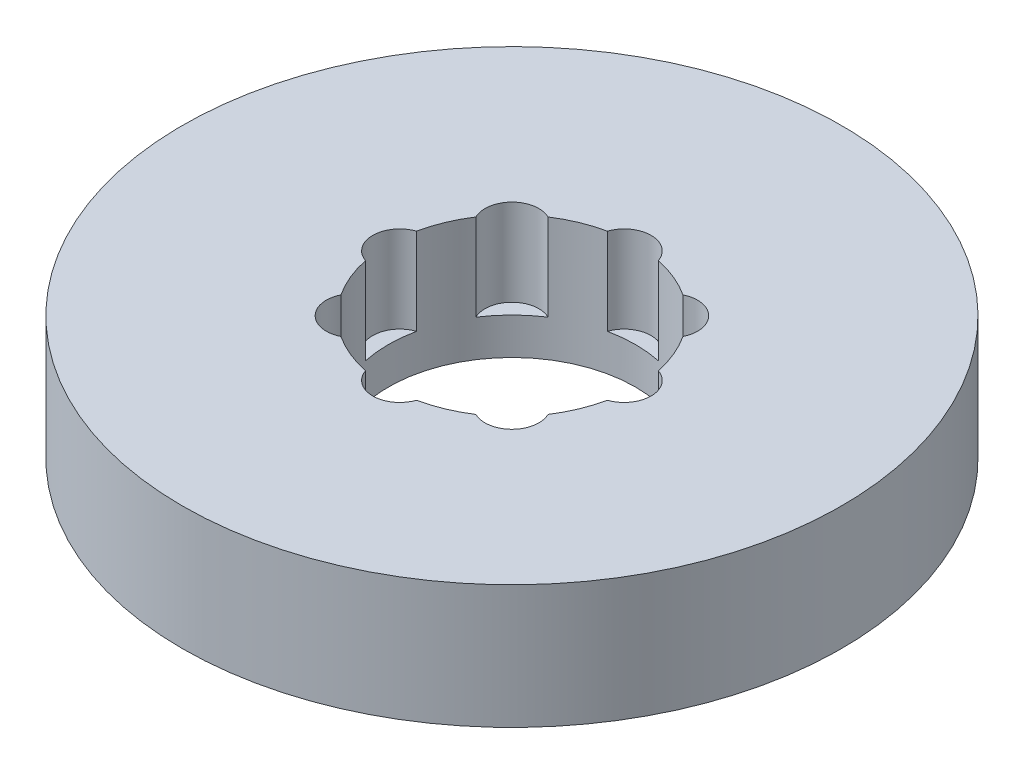
ISO-10303-21;
HEADER;
FILE_DESCRIPTION(('STEP AP214'),'2;1');
FILE_NAME('part.step','',(''),(''),'','','');
FILE_SCHEMA(('AUTOMOTIVE_DESIGN { 1 0 10303 214 1 1 1 1 }'));
ENDSEC;
DATA;
#1=APPLICATION_CONTEXT('core data for automotive mechanical design processes');
#2=APPLICATION_PROTOCOL_DEFINITION('international standard','automotive_design',2000,#1);
#3=PRODUCT_CONTEXT('',#1,'mechanical');
#4=PRODUCT('Part','Part','',(#3));
#5=PRODUCT_RELATED_PRODUCT_CATEGORY('part','',(#4));
#6=PRODUCT_DEFINITION_FORMATION('','',#4);
#7=PRODUCT_DEFINITION_CONTEXT('part definition',#1,'design');
#8=PRODUCT_DEFINITION('design','',#6,#7);
#9=PRODUCT_DEFINITION_SHAPE('','',#8);
#10=(LENGTH_UNIT() NAMED_UNIT(*) SI_UNIT(.MILLI.,.METRE.));
#11=(NAMED_UNIT(*) PLANE_ANGLE_UNIT() SI_UNIT($,.RADIAN.));
#12=(NAMED_UNIT(*) SI_UNIT($,.STERADIAN.) SOLID_ANGLE_UNIT());
#13=UNCERTAINTY_MEASURE_WITH_UNIT(LENGTH_MEASURE(1.E-05),#10,'distance_accuracy_value','');
#14=(GEOMETRIC_REPRESENTATION_CONTEXT(3) GLOBAL_UNCERTAINTY_ASSIGNED_CONTEXT((#13)) GLOBAL_UNIT_ASSIGNED_CONTEXT((#10,
#11,#12)) REPRESENTATION_CONTEXT('',''));
#15=CARTESIAN_POINT('',(0.,0.,0.));
#16=DIRECTION('',(0.,0.,1.));
#17=DIRECTION('',(1.,0.,0.));
#18=AXIS2_PLACEMENT_3D('',#15,#16,#17);
#19=CARTESIAN_POINT('',(0.,15.,0.));
#20=DIRECTION('',(0.,-1.,0.));
#21=DIRECTION('',(0.,0.,-1.));
#22=AXIS2_PLACEMENT_3D('',#19,#20,#21);
#23=CYLINDRICAL_SURFACE('',#22,40.);
#24=CARTESIAN_POINT('',(0.,15.,0.));
#25=DIRECTION('',(0.,1.,0.));
#26=DIRECTION('',(0.,0.,1.));
#27=AXIS2_PLACEMENT_3D('',#24,#25,#26);
#28=CIRCLE('',#27,40.);
#29=CARTESIAN_POINT('',(0.,15.,40.));
#30=VERTEX_POINT('',#29);
#31=EDGE_CURVE('E183',#30,#30,#28,.T.);
#32=ORIENTED_EDGE('',*,*,#31,.F.);
#33=EDGE_LOOP('',(#32));
#34=FACE_BOUND('',#33,.T.);
#35=CARTESIAN_POINT('',(0.,0.,0.));
#36=DIRECTION('',(0.,1.,0.));
#37=DIRECTION('',(0.,0.,1.));
#38=AXIS2_PLACEMENT_3D('',#35,#36,#37);
#39=CIRCLE('',#38,40.);
#40=CARTESIAN_POINT('',(0.,0.,40.));
#41=VERTEX_POINT('',#40);
#42=EDGE_CURVE('E182',#41,#41,#39,.T.);
#43=ORIENTED_EDGE('',*,*,#42,.T.);
#44=EDGE_LOOP('',(#43));
#45=FACE_BOUND('',#44,.T.);
#46=ADVANCED_FACE('F39',(#34,#45),#23,.T.);
#47=CARTESIAN_POINT('',(0.,15.,0.));
#48=DIRECTION('',(0.,1.,0.));
#49=DIRECTION('',(0.,0.,1.));
#50=AXIS2_PLACEMENT_3D('',#47,#48,#49);
#51=PLANE('',#50);
#52=CARTESIAN_POINT('',(0.,15.,13.6181477200669));
#53=DIRECTION('',(0.,1.,0.));
#54=DIRECTION('',(1.,0.,0.));
#55=AXIS2_PLACEMENT_3D('',#52,#53,#54);
#56=CIRCLE('',#55,3.27229028538122);
#57=CARTESIAN_POINT('',(-3.09625528298317,15.,14.6769616481954));
#58=VERTEX_POINT('',#57);
#59=CARTESIAN_POINT('',(3.09625528298327,15.,14.6769616481954));
#60=VERTEX_POINT('',#59);
#61=EDGE_CURVE('E256',#58,#60,#56,.T.);
#62=ORIENTED_EDGE('',*,*,#61,.F.);
#63=CARTESIAN_POINT('',(0.,15.,0.));
#64=DIRECTION('',(0.,1.,0.));
#65=DIRECTION('',(0.,0.,1.));
#66=AXIS2_PLACEMENT_3D('',#63,#64,#65);
#67=CIRCLE('',#66,15.);
#68=CARTESIAN_POINT('',(-8.18879600177172,15.,12.567562215536));
#69=VERTEX_POINT('',#68);
#70=EDGE_CURVE('E175',#69,#58,#67,.T.);
#71=ORIENTED_EDGE('',*,*,#70,.F.);
#72=CARTESIAN_POINT('',(-9.62948460005944,15.,9.62948460005947));
#73=DIRECTION('',(0.,1.,0.));
#74=DIRECTION('',(0.707106781186549,0.,0.707106781186546));
#75=AXIS2_PLACEMENT_3D('',#72,#73,#74);
#76=CIRCLE('',#75,3.27229028538122);
#77=CARTESIAN_POINT('',(-12.5675622155359,15.,8.18879600177176));
#78=VERTEX_POINT('',#77);
#79=EDGE_CURVE('E152',#78,#69,#76,.T.);
#80=ORIENTED_EDGE('',*,*,#79,.F.);
#81=CARTESIAN_POINT('',(-14.6769616481954,15.,3.09625528298322));
#82=VERTEX_POINT('',#81);
#83=EDGE_CURVE('E168',#82,#78,#67,.T.);
#84=ORIENTED_EDGE('',*,*,#83,.F.);
#85=CARTESIAN_POINT('',(-13.6181477200669,15.,0.));
#86=DIRECTION('',(0.,1.,0.));
#87=DIRECTION('',(0.,0.,1.));
#88=AXIS2_PLACEMENT_3D('',#85,#86,#87);
#89=CIRCLE('',#88,3.27229028538122);
#90=CARTESIAN_POINT('',(-14.6769616481954,15.,-3.09625528298322));
#91=VERTEX_POINT('',#90);
#92=EDGE_CURVE('E205',#91,#82,#89,.T.);
#93=ORIENTED_EDGE('',*,*,#92,.F.);
#94=CARTESIAN_POINT('',(-12.5675622155361,15.,-8.18879600177159));
#95=VERTEX_POINT('',#94);
#96=EDGE_CURVE('E181',#95,#91,#67,.T.);
#97=ORIENTED_EDGE('',*,*,#96,.F.);
#98=CARTESIAN_POINT('',(-9.62948460005957,15.,-9.62948460005934));
#99=DIRECTION('',(0.,1.,0.));
#100=DIRECTION('',(-0.707106781186539,0.,0.707106781186556));
#101=AXIS2_PLACEMENT_3D('',#98,#99,#100);
#102=CIRCLE('',#101,3.27229028538122);
#103=CARTESIAN_POINT('',(-8.18879600177189,15.,-12.5675622155359));
#104=VERTEX_POINT('',#103);
#105=EDGE_CURVE('E453',#104,#95,#102,.T.);
#106=ORIENTED_EDGE('',*,*,#105,.F.);
#107=CARTESIAN_POINT('',(-3.09625528298338,15.,-14.6769616481954));
#108=VERTEX_POINT('',#107);
#109=EDGE_CURVE('E189',#108,#104,#67,.T.);
#110=ORIENTED_EDGE('',*,*,#109,.F.);
#111=CARTESIAN_POINT('',(-1.42642525902669E-13,15.,-13.6181477200669));
#112=DIRECTION('',(0.,1.,0.));
#113=DIRECTION('',(-1.,0.,0.));
#114=AXIS2_PLACEMENT_3D('',#111,#112,#113);
#115=CIRCLE('',#114,3.27229028538122);
#116=CARTESIAN_POINT('',(3.09625528298307,15.,-14.6769616481954));
#117=VERTEX_POINT('',#116);
#118=EDGE_CURVE('E462',#117,#108,#115,.T.);
#119=ORIENTED_EDGE('',*,*,#118,.F.);
#120=CARTESIAN_POINT('',(8.18879600177163,15.,-12.567562215536));
#121=VERTEX_POINT('',#120);
#122=EDGE_CURVE('E197',#121,#117,#67,.T.);
#123=ORIENTED_EDGE('',*,*,#122,.F.);
#124=CARTESIAN_POINT('',(9.62948460005937,15.,-9.62948460005954));
#125=DIRECTION('',(0.,1.,0.));
#126=DIRECTION('',(-0.707106781186554,0.,-0.707106781186541));
#127=AXIS2_PLACEMENT_3D('',#124,#125,#126);
#128=CIRCLE('',#127,3.27229028538122);
#129=CARTESIAN_POINT('',(12.5675622155359,15.,-8.18879600177185));
#130=VERTEX_POINT('',#129);
#131=EDGE_CURVE('E470',#130,#121,#128,.T.);
#132=ORIENTED_EDGE('',*,*,#131,.F.);
#133=CARTESIAN_POINT('',(14.6769616481954,15.,-3.09625528298322));
#134=VERTEX_POINT('',#133);
#135=EDGE_CURVE('E489',#134,#130,#67,.T.);
#136=ORIENTED_EDGE('',*,*,#135,.F.);
#137=CARTESIAN_POINT('',(13.6181477200669,15.,0.));
#138=DIRECTION('',(0.,1.,0.));
#139=DIRECTION('',(0.,0.,-1.));
#140=AXIS2_PLACEMENT_3D('',#137,#138,#139);
#141=CIRCLE('',#140,3.27229028538122);
#142=CARTESIAN_POINT('',(14.6769616481954,15.,3.09625528298322));
#143=VERTEX_POINT('',#142);
#144=EDGE_CURVE('E476',#143,#134,#141,.T.);
#145=ORIENTED_EDGE('',*,*,#144,.F.);
#146=CARTESIAN_POINT('',(12.567562215536,15.,8.18879600177168));
#147=VERTEX_POINT('',#146);
#148=EDGE_CURVE('E491',#147,#143,#67,.T.);
#149=ORIENTED_EDGE('',*,*,#148,.F.);
#150=CARTESIAN_POINT('',(9.62948460005951,15.,9.62948460005941));
#151=DIRECTION('',(0.,1.,0.));
#152=DIRECTION('',(0.707106781186544,0.,-0.707106781186551));
#153=AXIS2_PLACEMENT_3D('',#150,#151,#152);
#154=CIRCLE('',#153,3.27229028538122);
#155=CARTESIAN_POINT('',(8.18879600177181,15.,12.5675622155359));
#156=VERTEX_POINT('',#155);
#157=EDGE_CURVE('E475',#156,#147,#154,.T.);
#158=ORIENTED_EDGE('',*,*,#157,.F.);
#159=EDGE_CURVE('E190',#60,#156,#67,.T.);
#160=ORIENTED_EDGE('',*,*,#159,.F.);
#161=EDGE_LOOP('',(#62,#71,#80,#84,#93,#97,#106,#110,#119,#123,#132,#136,#145,#149,#158,#160));
#162=FACE_BOUND('',#161,.T.);
#163=ORIENTED_EDGE('',*,*,#31,.T.);
#164=EDGE_LOOP('',(#163));
#165=FACE_BOUND('',#164,.T.);
#166=ADVANCED_FACE('F170',(#162,#165),#51,.T.);
#167=CARTESIAN_POINT('',(0.,0.,0.));
#168=DIRECTION('',(0.,1.,0.));
#169=DIRECTION('',(0.,0.,1.));
#170=AXIS2_PLACEMENT_3D('',#167,#168,#169);
#171=PLANE('',#170);
#172=CARTESIAN_POINT('',(0.,0.,0.));
#173=DIRECTION('',(0.,1.,0.));
#174=DIRECTION('',(0.,0.,1.));
#175=AXIS2_PLACEMENT_3D('',#172,#173,#174);
#176=CIRCLE('',#175,15.);
#177=CARTESIAN_POINT('',(0.,0.,15.));
#178=VERTEX_POINT('',#177);
#179=EDGE_CURVE('E191',#178,#178,#176,.T.);
#180=ORIENTED_EDGE('',*,*,#179,.T.);
#181=EDGE_LOOP('',(#180));
#182=FACE_BOUND('',#181,.T.);
#183=ORIENTED_EDGE('',*,*,#42,.F.);
#184=EDGE_LOOP('',(#183));
#185=FACE_BOUND('',#184,.T.);
#186=ADVANCED_FACE('F277',(#182,#185),#171,.F.);
#187=CARTESIAN_POINT('',(0.,15.,0.));
#188=DIRECTION('',(0.,-1.,0.));
#189=DIRECTION('',(0.,0.,-1.));
#190=AXIS2_PLACEMENT_3D('',#187,#188,#189);
#191=CYLINDRICAL_SURFACE('',#190,15.);
#192=DIRECTION('',(0.,1.,0.));
#193=VECTOR('',#192,1.);
#194=CARTESIAN_POINT('',(-3.09625528298317,9.73461906871161,14.6769616481954));
#195=LINE('',#194,#193);
#196=CARTESIAN_POINT('',(-3.09625528298317,4.46923813742323,14.6769616481954));
#197=VERTEX_POINT('',#196);
#198=EDGE_CURVE('E11',#197,#58,#195,.T.);
#199=ORIENTED_EDGE('',*,*,#198,.F.);
#200=CARTESIAN_POINT('',(0.,4.46923813742323,0.));
#201=DIRECTION('',(0.,1.,0.));
#202=DIRECTION('',(0.,0.,1.));
#203=AXIS2_PLACEMENT_3D('',#200,#201,#202);
#204=CIRCLE('',#203,15.);
#205=CARTESIAN_POINT('',(3.09625528298327,4.46923813742323,14.6769616481954));
#206=VERTEX_POINT('',#205);
#207=EDGE_CURVE('E251',#197,#206,#204,.T.);
#208=ORIENTED_EDGE('',*,*,#207,.T.);
#209=DIRECTION('',(0.,1.,0.));
#210=VECTOR('',#209,1.);
#211=CARTESIAN_POINT('',(3.09625528298327,9.73461906871161,14.6769616481954));
#212=LINE('',#211,#210);
#213=EDGE_CURVE('E46',#60,#206,#212,.F.);
#214=ORIENTED_EDGE('',*,*,#213,.F.);
#215=ORIENTED_EDGE('',*,*,#159,.T.);
#216=DIRECTION('',(0.,1.,0.));
#217=VECTOR('',#216,1.);
#218=CARTESIAN_POINT('',(8.18879600177181,9.73461906871161,12.5675622155359));
#219=LINE('',#218,#217);
#220=CARTESIAN_POINT('',(8.18879600177181,4.46923813742323,12.5675622155359));
#221=VERTEX_POINT('',#220);
#222=EDGE_CURVE('E253',#221,#156,#219,.T.);
#223=ORIENTED_EDGE('',*,*,#222,.F.);
#224=CARTESIAN_POINT('',(0.,4.46923813742323,0.));
#225=DIRECTION('',(0.,1.,0.));
#226=DIRECTION('',(0.,0.,1.));
#227=AXIS2_PLACEMENT_3D('',#224,#225,#226);
#228=CIRCLE('',#227,15.);
#229=CARTESIAN_POINT('',(12.567562215536,4.46923813742323,8.18879600177168));
#230=VERTEX_POINT('',#229);
#231=EDGE_CURVE('E246',#221,#230,#228,.T.);
#232=ORIENTED_EDGE('',*,*,#231,.T.);
#233=DIRECTION('',(0.,1.,0.));
#234=VECTOR('',#233,1.);
#235=CARTESIAN_POINT('',(12.567562215536,9.73461906871161,8.18879600177168));
#236=LINE('',#235,#234);
#237=EDGE_CURVE('E248',#147,#230,#236,.F.);
#238=ORIENTED_EDGE('',*,*,#237,.F.);
#239=ORIENTED_EDGE('',*,*,#148,.T.);
#240=DIRECTION('',(0.,1.,0.));
#241=VECTOR('',#240,1.);
#242=CARTESIAN_POINT('',(14.6769616481954,9.73461906871161,3.09625528298322));
#243=LINE('',#242,#241);
#244=CARTESIAN_POINT('',(14.6769616481954,4.46923813742323,3.09625528298322));
#245=VERTEX_POINT('',#244);
#246=EDGE_CURVE('E243',#245,#143,#243,.T.);
#247=ORIENTED_EDGE('',*,*,#246,.F.);
#248=CARTESIAN_POINT('',(0.,4.46923813742323,0.));
#249=DIRECTION('',(0.,1.,0.));
#250=DIRECTION('',(0.,0.,1.));
#251=AXIS2_PLACEMENT_3D('',#248,#249,#250);
#252=CIRCLE('',#251,15.);
#253=CARTESIAN_POINT('',(14.6769616481954,4.46923813742323,-3.09625528298322));
#254=VERTEX_POINT('',#253);
#255=EDGE_CURVE('E236',#245,#254,#252,.T.);
#256=ORIENTED_EDGE('',*,*,#255,.T.);
#257=DIRECTION('',(0.,1.,0.));
#258=VECTOR('',#257,1.);
#259=CARTESIAN_POINT('',(14.6769616481954,9.73461906871161,-3.09625528298322));
#260=LINE('',#259,#258);
#261=EDGE_CURVE('E241',#134,#254,#260,.F.);
#262=ORIENTED_EDGE('',*,*,#261,.F.);
#263=ORIENTED_EDGE('',*,*,#135,.T.);
#264=DIRECTION('',(0.,1.,0.));
#265=VECTOR('',#264,1.);
#266=CARTESIAN_POINT('',(12.5675622155359,9.73461906871161,-8.18879600177185));
#267=LINE('',#266,#265);
#268=CARTESIAN_POINT('',(12.5675622155359,4.46923813742323,-8.18879600177185));
#269=VERTEX_POINT('',#268);
#270=EDGE_CURVE('E237',#269,#130,#267,.T.);
#271=ORIENTED_EDGE('',*,*,#270,.F.);
#272=CARTESIAN_POINT('',(0.,4.46923813742323,0.));
#273=DIRECTION('',(0.,1.,0.));
#274=DIRECTION('',(0.,0.,1.));
#275=AXIS2_PLACEMENT_3D('',#272,#273,#274);
#276=CIRCLE('',#275,15.);
#277=CARTESIAN_POINT('',(8.18879600177163,4.46923813742323,-12.567562215536));
#278=VERTEX_POINT('',#277);
#279=EDGE_CURVE('E229',#269,#278,#276,.T.);
#280=ORIENTED_EDGE('',*,*,#279,.T.);
#281=DIRECTION('',(0.,1.,0.));
#282=VECTOR('',#281,1.);
#283=CARTESIAN_POINT('',(8.18879600177164,9.73461906871161,-12.567562215536));
#284=LINE('',#283,#282);
#285=EDGE_CURVE('E232',#121,#278,#284,.F.);
#286=ORIENTED_EDGE('',*,*,#285,.F.);
#287=ORIENTED_EDGE('',*,*,#122,.T.);
#288=DIRECTION('',(0.,1.,0.));
#289=VECTOR('',#288,1.);
#290=CARTESIAN_POINT('',(3.09625528298307,9.73461906871161,-14.6769616481954));
#291=LINE('',#290,#289);
#292=CARTESIAN_POINT('',(3.09625528298307,4.46923813742323,-14.6769616481954));
#293=VERTEX_POINT('',#292);
#294=EDGE_CURVE('E227',#293,#117,#291,.T.);
#295=ORIENTED_EDGE('',*,*,#294,.F.);
#296=CARTESIAN_POINT('',(0.,4.46923813742323,0.));
#297=DIRECTION('',(0.,1.,0.));
#298=DIRECTION('',(0.,0.,1.));
#299=AXIS2_PLACEMENT_3D('',#296,#297,#298);
#300=CIRCLE('',#299,15.);
#301=CARTESIAN_POINT('',(-3.09625528298338,4.46923813742323,-14.6769616481954));
#302=VERTEX_POINT('',#301);
#303=EDGE_CURVE('E225',#293,#302,#300,.T.);
#304=ORIENTED_EDGE('',*,*,#303,.T.);
#305=DIRECTION('',(0.,1.,0.));
#306=VECTOR('',#305,1.);
#307=CARTESIAN_POINT('',(-3.09625528298338,9.73461906871161,-14.6769616481954));
#308=LINE('',#307,#306);
#309=EDGE_CURVE('E223',#108,#302,#308,.F.);
#310=ORIENTED_EDGE('',*,*,#309,.F.);
#311=ORIENTED_EDGE('',*,*,#109,.T.);
#312=DIRECTION('',(0.,1.,0.));
#313=VECTOR('',#312,1.);
#314=CARTESIAN_POINT('',(-8.1887960017719,9.73461906871161,-12.5675622155359));
#315=LINE('',#314,#313);
#316=CARTESIAN_POINT('',(-8.18879600177189,4.46923813742323,-12.5675622155359));
#317=VERTEX_POINT('',#316);
#318=EDGE_CURVE('E219',#317,#104,#315,.T.);
#319=ORIENTED_EDGE('',*,*,#318,.F.);
#320=CARTESIAN_POINT('',(0.,4.46923813742323,0.));
#321=DIRECTION('',(0.,1.,0.));
#322=DIRECTION('',(0.,0.,1.));
#323=AXIS2_PLACEMENT_3D('',#320,#321,#322);
#324=CIRCLE('',#323,15.);
#325=CARTESIAN_POINT('',(-12.5675622155361,4.46923813742323,-8.18879600177159));
#326=VERTEX_POINT('',#325);
#327=EDGE_CURVE('E159',#317,#326,#324,.T.);
#328=ORIENTED_EDGE('',*,*,#327,.T.);
#329=DIRECTION('',(0.,1.,0.));
#330=VECTOR('',#329,1.);
#331=CARTESIAN_POINT('',(-12.5675622155361,9.73461906871161,-8.18879600177159));
#332=LINE('',#331,#330);
#333=EDGE_CURVE('E220',#95,#326,#332,.F.);
#334=ORIENTED_EDGE('',*,*,#333,.F.);
#335=ORIENTED_EDGE('',*,*,#96,.T.);
#336=DIRECTION('',(0.,1.,0.));
#337=VECTOR('',#336,1.);
#338=CARTESIAN_POINT('',(-14.6769616481954,9.73461906871161,-3.09625528298322));
#339=LINE('',#338,#337);
#340=CARTESIAN_POINT('',(-14.6769616481954,4.46923813742323,-3.09625528298322));
#341=VERTEX_POINT('',#340);
#342=EDGE_CURVE('E209',#341,#91,#339,.T.);
#343=ORIENTED_EDGE('',*,*,#342,.F.);
#344=CARTESIAN_POINT('',(0.,4.46923813742323,0.));
#345=DIRECTION('',(0.,1.,0.));
#346=DIRECTION('',(0.,0.,1.));
#347=AXIS2_PLACEMENT_3D('',#344,#345,#346);
#348=CIRCLE('',#347,15.);
#349=CARTESIAN_POINT('',(-14.6769616481954,4.46923813742323,3.09625528298322));
#350=VERTEX_POINT('',#349);
#351=EDGE_CURVE('E206',#341,#350,#348,.T.);
#352=ORIENTED_EDGE('',*,*,#351,.T.);
#353=DIRECTION('',(0.,1.,0.));
#354=VECTOR('',#353,1.);
#355=CARTESIAN_POINT('',(-14.6769616481954,9.73461906871161,3.09625528298322));
#356=LINE('',#355,#354);
#357=EDGE_CURVE('E179',#82,#350,#356,.F.);
#358=ORIENTED_EDGE('',*,*,#357,.F.);
#359=ORIENTED_EDGE('',*,*,#83,.T.);
#360=DIRECTION('',(0.,1.,0.));
#361=VECTOR('',#360,1.);
#362=CARTESIAN_POINT('',(-12.5675622155359,9.73461906871161,8.18879600177176));
#363=LINE('',#362,#361);
#364=CARTESIAN_POINT('',(-12.5675622155359,4.46923813742323,8.18879600177176));
#365=VERTEX_POINT('',#364);
#366=EDGE_CURVE('E147',#365,#78,#363,.T.);
#367=ORIENTED_EDGE('',*,*,#366,.F.);
#368=CARTESIAN_POINT('',(0.,4.46923813742323,0.));
#369=DIRECTION('',(0.,1.,0.));
#370=DIRECTION('',(0.,0.,1.));
#371=AXIS2_PLACEMENT_3D('',#368,#369,#370);
#372=CIRCLE('',#371,15.);
#373=CARTESIAN_POINT('',(-8.18879600177172,4.46923813742323,12.567562215536));
#374=VERTEX_POINT('',#373);
#375=EDGE_CURVE('E215',#365,#374,#372,.T.);
#376=ORIENTED_EDGE('',*,*,#375,.T.);
#377=DIRECTION('',(0.,1.,0.));
#378=VECTOR('',#377,1.);
#379=CARTESIAN_POINT('',(-8.18879600177172,9.73461906871161,12.567562215536));
#380=LINE('',#379,#378);
#381=EDGE_CURVE('E161',#69,#374,#380,.F.);
#382=ORIENTED_EDGE('',*,*,#381,.F.);
#383=ORIENTED_EDGE('',*,*,#70,.T.);
#384=EDGE_LOOP('',(#199,#208,#214,#215,#223,#232,#238,#239,#247,#256,#262,#263,#271,#280,#286,
#287,#295,#304,#310,#311,#319,#328,#334,#335,#343,#352,#358,#359,#367,#376,#382,#383));
#385=FACE_BOUND('',#384,.T.);
#386=ORIENTED_EDGE('',*,*,#179,.F.);
#387=EDGE_LOOP('',(#386));
#388=FACE_BOUND('',#387,.T.);
#389=ADVANCED_FACE('F176',(#385,#388),#191,.F.);
#390=CARTESIAN_POINT('',(-13.6181477200669,4.46923813742323,0.));
#391=DIRECTION('',(0.,1.,0.));
#392=DIRECTION('',(0.,0.,1.));
#393=AXIS2_PLACEMENT_3D('',#390,#391,#392);
#394=CYLINDRICAL_SURFACE('',#393,3.27229028538122);
#395=ORIENTED_EDGE('',*,*,#342,.T.);
#396=ORIENTED_EDGE('',*,*,#92,.T.);
#397=ORIENTED_EDGE('',*,*,#357,.T.);
#398=CARTESIAN_POINT('',(-13.6181477200669,4.46923813742323,0.));
#399=DIRECTION('',(0.,1.,0.));
#400=DIRECTION('',(0.,0.,1.));
#401=AXIS2_PLACEMENT_3D('',#398,#399,#400);
#402=CIRCLE('',#401,3.27229028538122);
#403=EDGE_CURVE('E200',#341,#350,#402,.T.);
#404=ORIENTED_EDGE('',*,*,#403,.F.);
#405=EDGE_LOOP('',(#395,#396,#397,#404));
#406=FACE_BOUND('',#405,.T.);
#407=ADVANCED_FACE('F286',(#406),#394,.F.);
#408=CARTESIAN_POINT('',(-13.6181477200669,4.46923813742323,0.));
#409=DIRECTION('',(0.,1.,0.));
#410=DIRECTION('',(0.,0.,1.));
#411=AXIS2_PLACEMENT_3D('',#408,#409,#410);
#412=PLANE('',#411);
#413=ORIENTED_EDGE('',*,*,#403,.T.);
#414=ORIENTED_EDGE('',*,*,#351,.F.);
#415=EDGE_LOOP('',(#413,#414));
#416=FACE_BOUND('',#415,.T.);
#417=ADVANCED_FACE('F289',(#416),#412,.T.);
#418=CARTESIAN_POINT('',(-9.62948460005944,4.46923813742323,9.62948460005947));
#419=DIRECTION('',(0.,1.,0.));
#420=DIRECTION('',(0.,0.,1.));
#421=AXIS2_PLACEMENT_3D('',#418,#419,#420);
#422=CYLINDRICAL_SURFACE('',#421,3.27229028538122);
#423=ORIENTED_EDGE('',*,*,#366,.T.);
#424=ORIENTED_EDGE('',*,*,#79,.T.);
#425=ORIENTED_EDGE('',*,*,#381,.T.);
#426=CARTESIAN_POINT('',(-9.62948460005944,4.46923813742323,9.62948460005947));
#427=DIRECTION('',(0.,1.,0.));
#428=DIRECTION('',(0.707106781186549,0.,0.707106781186546));
#429=AXIS2_PLACEMENT_3D('',#426,#427,#428);
#430=CIRCLE('',#429,3.27229028538122);
#431=EDGE_CURVE('E156',#365,#374,#430,.T.);
#432=ORIENTED_EDGE('',*,*,#431,.F.);
#433=EDGE_LOOP('',(#423,#424,#425,#432));
#434=FACE_BOUND('',#433,.T.);
#435=ADVANCED_FACE('F155',(#434),#422,.F.);
#436=CARTESIAN_POINT('',(-9.62948460005944,4.46923813742323,9.62948460005947));
#437=DIRECTION('',(0.,1.,0.));
#438=DIRECTION('',(0.707106781186549,0.,0.707106781186546));
#439=AXIS2_PLACEMENT_3D('',#436,#437,#438);
#440=PLANE('',#439);
#441=ORIENTED_EDGE('',*,*,#431,.T.);
#442=ORIENTED_EDGE('',*,*,#375,.F.);
#443=EDGE_LOOP('',(#441,#442));
#444=FACE_BOUND('',#443,.T.);
#445=ADVANCED_FACE('F300',(#444),#440,.T.);
#446=CARTESIAN_POINT('',(-9.62948460005957,4.46923813742323,-9.62948460005934));
#447=DIRECTION('',(0.,1.,0.));
#448=DIRECTION('',(0.,0.,1.));
#449=AXIS2_PLACEMENT_3D('',#446,#447,#448);
#450=CYLINDRICAL_SURFACE('',#449,3.27229028538122);
#451=ORIENTED_EDGE('',*,*,#318,.T.);
#452=ORIENTED_EDGE('',*,*,#105,.T.);
#453=ORIENTED_EDGE('',*,*,#333,.T.);
#454=CARTESIAN_POINT('',(-9.62948460005957,4.46923813742323,-9.62948460005934));
#455=DIRECTION('',(0.,1.,0.));
#456=DIRECTION('',(-0.707106781186539,0.,0.707106781186556));
#457=AXIS2_PLACEMENT_3D('',#454,#455,#456);
#458=CIRCLE('',#457,3.27229028538122);
#459=EDGE_CURVE('E454',#317,#326,#458,.T.);
#460=ORIENTED_EDGE('',*,*,#459,.F.);
#461=EDGE_LOOP('',(#451,#452,#453,#460));
#462=FACE_BOUND('',#461,.T.);
#463=ADVANCED_FACE('F299',(#462),#450,.F.);
#464=CARTESIAN_POINT('',(-9.62948460005957,4.46923813742323,-9.62948460005934));
#465=DIRECTION('',(0.,1.,0.));
#466=DIRECTION('',(-0.707106781186539,0.,0.707106781186556));
#467=AXIS2_PLACEMENT_3D('',#464,#465,#466);
#468=PLANE('',#467);
#469=ORIENTED_EDGE('',*,*,#459,.T.);
#470=ORIENTED_EDGE('',*,*,#327,.F.);
#471=EDGE_LOOP('',(#469,#470));
#472=FACE_BOUND('',#471,.T.);
#473=ADVANCED_FACE('F379',(#472),#468,.T.);
#474=CARTESIAN_POINT('',(-1.42642525902669E-13,4.46923813742323,-13.6181477200669));
#475=DIRECTION('',(0.,1.,0.));
#476=DIRECTION('',(0.,0.,1.));
#477=AXIS2_PLACEMENT_3D('',#474,#475,#476);
#478=CYLINDRICAL_SURFACE('',#477,3.27229028538122);
#479=ORIENTED_EDGE('',*,*,#294,.T.);
#480=ORIENTED_EDGE('',*,*,#118,.T.);
#481=ORIENTED_EDGE('',*,*,#309,.T.);
#482=CARTESIAN_POINT('',(-1.42642525902669E-13,4.46923813742323,-13.6181477200669));
#483=DIRECTION('',(0.,1.,0.));
#484=DIRECTION('',(-1.,0.,0.));
#485=AXIS2_PLACEMENT_3D('',#482,#483,#484);
#486=CIRCLE('',#485,3.27229028538122);
#487=EDGE_CURVE('E465',#293,#302,#486,.T.);
#488=ORIENTED_EDGE('',*,*,#487,.F.);
#489=EDGE_LOOP('',(#479,#480,#481,#488));
#490=FACE_BOUND('',#489,.T.);
#491=ADVANCED_FACE('F371',(#490),#478,.F.);
#492=CARTESIAN_POINT('',(-1.42642525902669E-13,4.46923813742323,-13.6181477200669));
#493=DIRECTION('',(0.,1.,0.));
#494=DIRECTION('',(-1.,0.,0.));
#495=AXIS2_PLACEMENT_3D('',#492,#493,#494);
#496=PLANE('',#495);
#497=ORIENTED_EDGE('',*,*,#487,.T.);
#498=ORIENTED_EDGE('',*,*,#303,.F.);
#499=EDGE_LOOP('',(#497,#498));
#500=FACE_BOUND('',#499,.T.);
#501=ADVANCED_FACE('F308',(#500),#496,.T.);
#502=CARTESIAN_POINT('',(9.62948460005937,4.46923813742323,-9.62948460005954));
#503=DIRECTION('',(0.,1.,0.));
#504=DIRECTION('',(0.,0.,1.));
#505=AXIS2_PLACEMENT_3D('',#502,#503,#504);
#506=CYLINDRICAL_SURFACE('',#505,3.27229028538122);
#507=ORIENTED_EDGE('',*,*,#270,.T.);
#508=ORIENTED_EDGE('',*,*,#131,.T.);
#509=ORIENTED_EDGE('',*,*,#285,.T.);
#510=CARTESIAN_POINT('',(9.62948460005937,4.46923813742323,-9.62948460005954));
#511=DIRECTION('',(0.,1.,0.));
#512=DIRECTION('',(-0.707106781186554,0.,-0.707106781186541));
#513=AXIS2_PLACEMENT_3D('',#510,#511,#512);
#514=CIRCLE('',#513,3.27229028538122);
#515=EDGE_CURVE('E477',#269,#278,#514,.T.);
#516=ORIENTED_EDGE('',*,*,#515,.F.);
#517=EDGE_LOOP('',(#507,#508,#509,#516));
#518=FACE_BOUND('',#517,.T.);
#519=ADVANCED_FACE('F305',(#518),#506,.F.);
#520=CARTESIAN_POINT('',(9.62948460005937,4.46923813742323,-9.62948460005954));
#521=DIRECTION('',(0.,1.,0.));
#522=DIRECTION('',(-0.707106781186554,0.,-0.707106781186541));
#523=AXIS2_PLACEMENT_3D('',#520,#521,#522);
#524=PLANE('',#523);
#525=ORIENTED_EDGE('',*,*,#515,.T.);
#526=ORIENTED_EDGE('',*,*,#279,.F.);
#527=EDGE_LOOP('',(#525,#526));
#528=FACE_BOUND('',#527,.T.);
#529=ADVANCED_FACE('F304',(#528),#524,.T.);
#530=CARTESIAN_POINT('',(13.6181477200669,4.46923813742323,0.));
#531=DIRECTION('',(0.,1.,0.));
#532=DIRECTION('',(0.,0.,1.));
#533=AXIS2_PLACEMENT_3D('',#530,#531,#532);
#534=CYLINDRICAL_SURFACE('',#533,3.27229028538122);
#535=ORIENTED_EDGE('',*,*,#246,.T.);
#536=ORIENTED_EDGE('',*,*,#144,.T.);
#537=ORIENTED_EDGE('',*,*,#261,.T.);
#538=CARTESIAN_POINT('',(13.6181477200669,4.46923813742323,0.));
#539=DIRECTION('',(0.,1.,0.));
#540=DIRECTION('',(0.,0.,-1.));
#541=AXIS2_PLACEMENT_3D('',#538,#539,#540);
#542=CIRCLE('',#541,3.27229028538122);
#543=EDGE_CURVE('E478',#245,#254,#542,.T.);
#544=ORIENTED_EDGE('',*,*,#543,.F.);
#545=EDGE_LOOP('',(#535,#536,#537,#544));
#546=FACE_BOUND('',#545,.T.);
#547=ADVANCED_FACE('F309',(#546),#534,.F.);
#548=CARTESIAN_POINT('',(13.6181477200669,4.46923813742323,0.));
#549=DIRECTION('',(0.,1.,0.));
#550=DIRECTION('',(0.,0.,-1.));
#551=AXIS2_PLACEMENT_3D('',#548,#549,#550);
#552=PLANE('',#551);
#553=ORIENTED_EDGE('',*,*,#543,.T.);
#554=ORIENTED_EDGE('',*,*,#255,.F.);
#555=EDGE_LOOP('',(#553,#554));
#556=FACE_BOUND('',#555,.T.);
#557=ADVANCED_FACE('F314',(#556),#552,.T.);
#558=CARTESIAN_POINT('',(9.62948460005951,4.46923813742323,9.62948460005941));
#559=DIRECTION('',(0.,1.,0.));
#560=DIRECTION('',(0.,0.,1.));
#561=AXIS2_PLACEMENT_3D('',#558,#559,#560);
#562=CYLINDRICAL_SURFACE('',#561,3.27229028538122);
#563=ORIENTED_EDGE('',*,*,#222,.T.);
#564=ORIENTED_EDGE('',*,*,#157,.T.);
#565=ORIENTED_EDGE('',*,*,#237,.T.);
#566=CARTESIAN_POINT('',(9.62948460005951,4.46923813742323,9.62948460005941));
#567=DIRECTION('',(0.,1.,0.));
#568=DIRECTION('',(0.707106781186544,0.,-0.707106781186551));
#569=AXIS2_PLACEMENT_3D('',#566,#567,#568);
#570=CIRCLE('',#569,3.27229028538122);
#571=EDGE_CURVE('E56',#221,#230,#570,.T.);
#572=ORIENTED_EDGE('',*,*,#571,.F.);
#573=EDGE_LOOP('',(#563,#564,#565,#572));
#574=FACE_BOUND('',#573,.T.);
#575=ADVANCED_FACE('F318',(#574),#562,.F.);
#576=CARTESIAN_POINT('',(9.62948460005951,4.46923813742323,9.62948460005941));
#577=DIRECTION('',(0.,1.,0.));
#578=DIRECTION('',(0.707106781186544,0.,-0.707106781186551));
#579=AXIS2_PLACEMENT_3D('',#576,#577,#578);
#580=PLANE('',#579);
#581=ORIENTED_EDGE('',*,*,#571,.T.);
#582=ORIENTED_EDGE('',*,*,#231,.F.);
#583=EDGE_LOOP('',(#581,#582));
#584=FACE_BOUND('',#583,.T.);
#585=ADVANCED_FACE('F270',(#584),#580,.T.);
#586=CARTESIAN_POINT('',(0.,4.46923813742323,13.6181477200669));
#587=DIRECTION('',(0.,1.,0.));
#588=DIRECTION('',(0.,0.,1.));
#589=AXIS2_PLACEMENT_3D('',#586,#587,#588);
#590=CYLINDRICAL_SURFACE('',#589,3.27229028538122);
#591=ORIENTED_EDGE('',*,*,#198,.T.);
#592=ORIENTED_EDGE('',*,*,#61,.T.);
#593=ORIENTED_EDGE('',*,*,#213,.T.);
#594=CARTESIAN_POINT('',(0.,4.46923813742323,13.6181477200669));
#595=DIRECTION('',(0.,1.,0.));
#596=DIRECTION('',(1.,0.,0.));
#597=AXIS2_PLACEMENT_3D('',#594,#595,#596);
#598=CIRCLE('',#597,3.27229028538122);
#599=EDGE_CURVE('E55',#197,#206,#598,.T.);
#600=ORIENTED_EDGE('',*,*,#599,.F.);
#601=EDGE_LOOP('',(#591,#592,#593,#600));
#602=FACE_BOUND('',#601,.T.);
#603=ADVANCED_FACE('F260',(#602),#590,.F.);
#604=CARTESIAN_POINT('',(0.,4.46923813742323,13.6181477200669));
#605=DIRECTION('',(0.,1.,0.));
#606=DIRECTION('',(1.,0.,0.));
#607=AXIS2_PLACEMENT_3D('',#604,#605,#606);
#608=PLANE('',#607);
#609=ORIENTED_EDGE('',*,*,#599,.T.);
#610=ORIENTED_EDGE('',*,*,#207,.F.);
#611=EDGE_LOOP('',(#609,#610));
#612=FACE_BOUND('',#611,.T.);
#613=ADVANCED_FACE('F261',(#612),#608,.T.);
#614=CLOSED_SHELL('',(#46,#166,#186,#389,#407,#417,#435,#445,#463,#473,#491,#501,#519,#529,#547,
#557,#575,#585,#603,#613));
#615=MANIFOLD_SOLID_BREP('B2',#614);
#616=ADVANCED_BREP_SHAPE_REPRESENTATION('',(#18,#615),#14);
#617=SHAPE_DEFINITION_REPRESENTATION(#9,#616);
ENDSEC;
END-ISO-10303-21;
